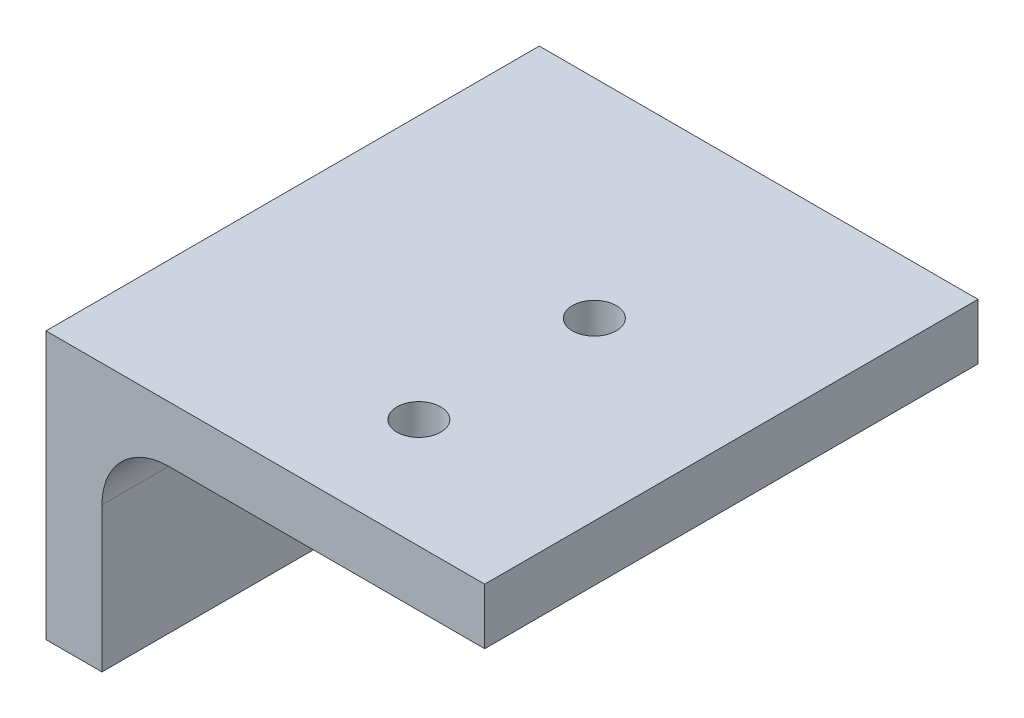
ISO-10303-21;
HEADER;
FILE_DESCRIPTION(('STEP AP214'),'2;1');
FILE_NAME('part.step','',(''),(''),'','','');
FILE_SCHEMA(('AUTOMOTIVE_DESIGN { 1 0 10303 214 1 1 1 1 }'));
ENDSEC;
DATA;
#1=APPLICATION_CONTEXT('core data for automotive mechanical design processes');
#2=APPLICATION_PROTOCOL_DEFINITION('international standard','automotive_design',2000,#1);
#3=PRODUCT_CONTEXT('',#1,'mechanical');
#4=PRODUCT('Part','Part','',(#3));
#5=PRODUCT_RELATED_PRODUCT_CATEGORY('part','',(#4));
#6=PRODUCT_DEFINITION_FORMATION('','',#4);
#7=PRODUCT_DEFINITION_CONTEXT('part definition',#1,'design');
#8=PRODUCT_DEFINITION('design','',#6,#7);
#9=PRODUCT_DEFINITION_SHAPE('','',#8);
#10=(LENGTH_UNIT() NAMED_UNIT(*) SI_UNIT(.MILLI.,.METRE.));
#11=(NAMED_UNIT(*) PLANE_ANGLE_UNIT() SI_UNIT($,.RADIAN.));
#12=(NAMED_UNIT(*) SI_UNIT($,.STERADIAN.) SOLID_ANGLE_UNIT());
#13=UNCERTAINTY_MEASURE_WITH_UNIT(LENGTH_MEASURE(1.E-05),#10,'distance_accuracy_value','');
#14=(GEOMETRIC_REPRESENTATION_CONTEXT(3) GLOBAL_UNCERTAINTY_ASSIGNED_CONTEXT((#13)) GLOBAL_UNIT_ASSIGNED_CONTEXT((#10,
#11,#12)) REPRESENTATION_CONTEXT('',''));
#15=CARTESIAN_POINT('',(0.,0.,0.));
#16=DIRECTION('',(0.,0.,1.));
#17=DIRECTION('',(1.,0.,0.));
#18=AXIS2_PLACEMENT_3D('',#15,#16,#17);
#19=CARTESIAN_POINT('',(95.3299999999999,-9.4,-56.22));
#20=DIRECTION('',(0.,1.,0.));
#21=DIRECTION('',(-1.,0.,0.));
#22=AXIS2_PLACEMENT_3D('',#19,#20,#21);
#23=PLANE('',#22);
#24=CARTESIAN_POINT('',(75.3299999999999,-9.40000000000002,-12.4935884323905));
#25=DIRECTION('',(0.,1.,0.));
#26=DIRECTION('',(0.,0.,1.));
#27=AXIS2_PLACEMENT_3D('',#24,#25,#26);
#28=CIRCLE('',#27,2.49999999999999);
#29=CARTESIAN_POINT('',(75.3299999999999,-9.40000000000002,-9.99358843239047));
#30=VERTEX_POINT('',#29);
#31=EDGE_CURVE('E152',#30,#30,#28,.T.);
#32=ORIENTED_EDGE('',*,*,#31,.F.);
#33=EDGE_LOOP('',(#32));
#34=FACE_BOUND('',#33,.T.);
#35=CARTESIAN_POINT('',(75.3299999999999,-9.40000000000002,-32.4935884323905));
#36=DIRECTION('',(0.,1.,0.));
#37=DIRECTION('',(0.,0.,1.));
#38=AXIS2_PLACEMENT_3D('',#35,#36,#37);
#39=CIRCLE('',#38,2.50000000000001);
#40=CARTESIAN_POINT('',(75.3299999999999,-9.40000000000002,-29.9935884323905));
#41=VERTEX_POINT('',#40);
#42=EDGE_CURVE('E157',#41,#41,#39,.T.);
#43=ORIENTED_EDGE('',*,*,#42,.F.);
#44=EDGE_LOOP('',(#43));
#45=FACE_BOUND('',#44,.T.);
#46=DIRECTION('',(-1.,0.,0.));
#47=VECTOR('',#46,1.);
#48=CARTESIAN_POINT('',(95.3299999999999,-9.4,0.));
#49=LINE('',#48,#47);
#50=CARTESIAN_POINT('',(95.3299999999999,-9.4,0.));
#51=VERTEX_POINT('',#50);
#52=CARTESIAN_POINT('',(45.3299999999999,-9.40000000000001,0.));
#53=VERTEX_POINT('',#52);
#54=EDGE_CURVE('E125',#51,#53,#49,.T.);
#55=ORIENTED_EDGE('',*,*,#54,.F.);
#56=DIRECTION('',(0.,0.,1.));
#57=VECTOR('',#56,1.);
#58=CARTESIAN_POINT('',(95.3299999999999,-9.4,-56.22));
#59=LINE('',#58,#57);
#60=CARTESIAN_POINT('',(95.3299999999999,-9.4,-56.22));
#61=VERTEX_POINT('',#60);
#62=EDGE_CURVE('E11',#61,#51,#59,.T.);
#63=ORIENTED_EDGE('',*,*,#62,.F.);
#64=DIRECTION('',(-1.,0.,0.));
#65=VECTOR('',#64,1.);
#66=CARTESIAN_POINT('',(95.3299999999999,-9.4,-56.22));
#67=LINE('',#66,#65);
#68=CARTESIAN_POINT('',(45.3299999999999,-9.40000000000001,-56.22));
#69=VERTEX_POINT('',#68);
#70=EDGE_CURVE('E142',#61,#69,#67,.T.);
#71=ORIENTED_EDGE('',*,*,#70,.T.);
#72=DIRECTION('',(0.,0.,1.));
#73=VECTOR('',#72,1.);
#74=CARTESIAN_POINT('',(45.3299999999999,-9.40000000000001,-56.22));
#75=LINE('',#74,#73);
#76=EDGE_CURVE('E86',#69,#53,#75,.T.);
#77=ORIENTED_EDGE('',*,*,#76,.T.);
#78=EDGE_LOOP('',(#55,#63,#71,#77));
#79=FACE_BOUND('',#78,.T.);
#80=ADVANCED_FACE('F33',(#34,#45,#79),#23,.T.);
#81=CARTESIAN_POINT('',(95.3299999999999,-15.7754,-56.22));
#82=DIRECTION('',(1.,0.,0.));
#83=DIRECTION('',(0.,0.,-1.));
#84=AXIS2_PLACEMENT_3D('',#81,#82,#83);
#85=PLANE('',#84);
#86=DIRECTION('',(0.,1.,0.));
#87=VECTOR('',#86,1.);
#88=CARTESIAN_POINT('',(95.3299999999999,-15.7754,0.));
#89=LINE('',#88,#87);
#90=CARTESIAN_POINT('',(95.3299999999999,-15.7754,0.));
#91=VERTEX_POINT('',#90);
#92=EDGE_CURVE('E140',#91,#51,#89,.T.);
#93=ORIENTED_EDGE('',*,*,#92,.F.);
#94=DIRECTION('',(0.,0.,1.));
#95=VECTOR('',#94,1.);
#96=CARTESIAN_POINT('',(95.3299999999999,-15.7754,-56.22));
#97=LINE('',#96,#95);
#98=CARTESIAN_POINT('',(95.3299999999999,-15.7754,-56.22));
#99=VERTEX_POINT('',#98);
#100=EDGE_CURVE('E42',#99,#91,#97,.T.);
#101=ORIENTED_EDGE('',*,*,#100,.F.);
#102=DIRECTION('',(0.,1.,0.));
#103=VECTOR('',#102,1.);
#104=CARTESIAN_POINT('',(95.3299999999999,-15.7754,-56.22));
#105=LINE('',#104,#103);
#106=EDGE_CURVE('E115',#99,#61,#105,.T.);
#107=ORIENTED_EDGE('',*,*,#106,.T.);
#108=ORIENTED_EDGE('',*,*,#62,.T.);
#109=EDGE_LOOP('',(#93,#101,#107,#108));
#110=FACE_BOUND('',#109,.T.);
#111=ADVANCED_FACE('F178',(#110),#85,.T.);
#112=CARTESIAN_POINT('',(59.3253999999999,-15.7754,-56.22));
#113=DIRECTION('',(0.,-1.,0.));
#114=DIRECTION('',(0.,0.,-1.));
#115=AXIS2_PLACEMENT_3D('',#112,#113,#114);
#116=PLANE('',#115);
#117=CARTESIAN_POINT('',(75.3299999999999,-15.7754,-12.4935884323905));
#118=DIRECTION('',(0.,-1.,0.));
#119=DIRECTION('',(0.,0.,-1.));
#120=AXIS2_PLACEMENT_3D('',#117,#118,#119);
#121=CIRCLE('',#120,2.49999999999999);
#122=CARTESIAN_POINT('',(75.3299999999999,-15.7754,-14.9935884323905));
#123=VERTEX_POINT('',#122);
#124=EDGE_CURVE('E36',#123,#123,#121,.T.);
#125=ORIENTED_EDGE('',*,*,#124,.F.);
#126=EDGE_LOOP('',(#125));
#127=FACE_BOUND('',#126,.T.);
#128=CARTESIAN_POINT('',(75.3299999999999,-15.7754,-32.4935884323905));
#129=DIRECTION('',(0.,-1.,0.));
#130=DIRECTION('',(0.,0.,-1.));
#131=AXIS2_PLACEMENT_3D('',#128,#129,#130);
#132=CIRCLE('',#131,2.50000000000001);
#133=CARTESIAN_POINT('',(75.3299999999999,-15.7754,-34.9935884323905));
#134=VERTEX_POINT('',#133);
#135=EDGE_CURVE('E150',#134,#134,#132,.T.);
#136=ORIENTED_EDGE('',*,*,#135,.F.);
#137=EDGE_LOOP('',(#136));
#138=FACE_BOUND('',#137,.T.);
#139=DIRECTION('',(1.,0.,0.));
#140=VECTOR('',#139,1.);
#141=CARTESIAN_POINT('',(59.3253999999999,-15.7754,0.));
#142=LINE('',#141,#140);
#143=CARTESIAN_POINT('',(59.3253999999999,-15.7754,0.));
#144=VERTEX_POINT('',#143);
#145=EDGE_CURVE('E102',#144,#91,#142,.T.);
#146=ORIENTED_EDGE('',*,*,#145,.F.);
#147=DIRECTION('',(0.,0.,1.));
#148=VECTOR('',#147,1.);
#149=CARTESIAN_POINT('',(59.3253999999999,-15.7754,-56.22));
#150=LINE('',#149,#148);
#151=CARTESIAN_POINT('',(59.3253999999999,-15.7754,-56.22));
#152=VERTEX_POINT('',#151);
#153=EDGE_CURVE('E97',#152,#144,#150,.T.);
#154=ORIENTED_EDGE('',*,*,#153,.F.);
#155=DIRECTION('',(1.,0.,0.));
#156=VECTOR('',#155,1.);
#157=CARTESIAN_POINT('',(59.3253999999999,-15.7754,-56.22));
#158=LINE('',#157,#156);
#159=EDGE_CURVE('E100',#152,#99,#158,.T.);
#160=ORIENTED_EDGE('',*,*,#159,.T.);
#161=ORIENTED_EDGE('',*,*,#100,.T.);
#162=EDGE_LOOP('',(#146,#154,#160,#161));
#163=FACE_BOUND('',#162,.T.);
#164=ADVANCED_FACE('F99',(#127,#138,#163),#116,.T.);
#165=CARTESIAN_POINT('',(59.3253999999999,-23.3954,-56.22));
#166=DIRECTION('',(0.,0.,1.));
#167=DIRECTION('',(1.,0.,0.));
#168=AXIS2_PLACEMENT_3D('',#165,#166,#167);
#169=CYLINDRICAL_SURFACE('',#168,7.62);
#170=CARTESIAN_POINT('',(59.3253999999999,-23.3954,0.));
#171=DIRECTION('',(0.,0.,-1.));
#172=DIRECTION('',(1.,0.,0.));
#173=AXIS2_PLACEMENT_3D('',#170,#171,#172);
#174=CIRCLE('',#173,7.62);
#175=CARTESIAN_POINT('',(51.7053999999999,-23.3954,0.));
#176=VERTEX_POINT('',#175);
#177=EDGE_CURVE('E137',#176,#144,#174,.T.);
#178=ORIENTED_EDGE('',*,*,#177,.F.);
#179=DIRECTION('',(0.,0.,1.));
#180=VECTOR('',#179,1.);
#181=CARTESIAN_POINT('',(51.7053999999999,-23.3954,-56.22));
#182=LINE('',#181,#180);
#183=CARTESIAN_POINT('',(51.7053999999999,-23.3954,-56.22));
#184=VERTEX_POINT('',#183);
#185=EDGE_CURVE('E107',#184,#176,#182,.T.);
#186=ORIENTED_EDGE('',*,*,#185,.F.);
#187=CARTESIAN_POINT('',(59.3253999999999,-23.3954,-56.22));
#188=DIRECTION('',(0.,0.,-1.));
#189=DIRECTION('',(1.,0.,0.));
#190=AXIS2_PLACEMENT_3D('',#187,#188,#189);
#191=CIRCLE('',#190,7.62);
#192=EDGE_CURVE('E113',#184,#152,#191,.T.);
#193=ORIENTED_EDGE('',*,*,#192,.T.);
#194=ORIENTED_EDGE('',*,*,#153,.T.);
#195=EDGE_LOOP('',(#178,#186,#193,#194));
#196=FACE_BOUND('',#195,.T.);
#197=ADVANCED_FACE('F117',(#196),#169,.F.);
#198=CARTESIAN_POINT('',(51.7053999999999,-39.88,-56.22));
#199=DIRECTION('',(1.,0.,0.));
#200=DIRECTION('',(0.,0.,-1.));
#201=AXIS2_PLACEMENT_3D('',#198,#199,#200);
#202=PLANE('',#201);
#203=CARTESIAN_POINT('',(51.7053999999999,-27.18,-32.598));
#204=DIRECTION('',(1.,0.,0.));
#205=DIRECTION('',(0.,0.,-1.));
#206=AXIS2_PLACEMENT_3D('',#203,#204,#205);
#207=CIRCLE('',#206,2.5);
#208=CARTESIAN_POINT('',(51.7053999999999,-27.18,-35.098));
#209=VERTEX_POINT('',#208);
#210=EDGE_CURVE('E162',#209,#209,#207,.T.);
#211=ORIENTED_EDGE('',*,*,#210,.F.);
#212=EDGE_LOOP('',(#211));
#213=FACE_BOUND('',#212,.T.);
#214=DIRECTION('',(0.,1.,0.));
#215=VECTOR('',#214,1.);
#216=CARTESIAN_POINT('',(51.7053999999999,-39.88,0.));
#217=LINE('',#216,#215);
#218=CARTESIAN_POINT('',(51.7053999999999,-39.88,0.));
#219=VERTEX_POINT('',#218);
#220=EDGE_CURVE('E134',#219,#176,#217,.T.);
#221=ORIENTED_EDGE('',*,*,#220,.F.);
#222=DIRECTION('',(0.,0.,1.));
#223=VECTOR('',#222,1.);
#224=CARTESIAN_POINT('',(51.7053999999999,-39.88,-56.22));
#225=LINE('',#224,#223);
#226=CARTESIAN_POINT('',(51.7053999999999,-39.88,-56.22));
#227=VERTEX_POINT('',#226);
#228=EDGE_CURVE('E146',#227,#219,#225,.T.);
#229=ORIENTED_EDGE('',*,*,#228,.F.);
#230=DIRECTION('',(0.,1.,0.));
#231=VECTOR('',#230,1.);
#232=CARTESIAN_POINT('',(51.7053999999999,-39.88,-56.22));
#233=LINE('',#232,#231);
#234=EDGE_CURVE('E118',#227,#184,#233,.T.);
#235=ORIENTED_EDGE('',*,*,#234,.T.);
#236=ORIENTED_EDGE('',*,*,#185,.T.);
#237=EDGE_LOOP('',(#221,#229,#235,#236));
#238=FACE_BOUND('',#237,.T.);
#239=ADVANCED_FACE('F193',(#213,#238),#202,.T.);
#240=CARTESIAN_POINT('',(45.3299999999999,-39.88,-56.22));
#241=DIRECTION('',(0.,-1.,0.));
#242=DIRECTION('',(0.,0.,-1.));
#243=AXIS2_PLACEMENT_3D('',#240,#241,#242);
#244=PLANE('',#243);
#245=DIRECTION('',(1.,0.,0.));
#246=VECTOR('',#245,1.);
#247=CARTESIAN_POINT('',(45.3299999999999,-39.88,0.));
#248=LINE('',#247,#246);
#249=CARTESIAN_POINT('',(45.3299999999999,-39.88,0.));
#250=VERTEX_POINT('',#249);
#251=EDGE_CURVE('E131',#250,#219,#248,.T.);
#252=ORIENTED_EDGE('',*,*,#251,.F.);
#253=DIRECTION('',(0.,0.,1.));
#254=VECTOR('',#253,1.);
#255=CARTESIAN_POINT('',(45.3299999999999,-39.88,-56.22));
#256=LINE('',#255,#254);
#257=CARTESIAN_POINT('',(45.3299999999999,-39.88,-56.22));
#258=VERTEX_POINT('',#257);
#259=EDGE_CURVE('E148',#258,#250,#256,.T.);
#260=ORIENTED_EDGE('',*,*,#259,.F.);
#261=DIRECTION('',(1.,0.,0.));
#262=VECTOR('',#261,1.);
#263=CARTESIAN_POINT('',(45.3299999999999,-39.88,-56.22));
#264=LINE('',#263,#262);
#265=EDGE_CURVE('E120',#258,#227,#264,.T.);
#266=ORIENTED_EDGE('',*,*,#265,.T.);
#267=ORIENTED_EDGE('',*,*,#228,.T.);
#268=EDGE_LOOP('',(#252,#260,#266,#267));
#269=FACE_BOUND('',#268,.T.);
#270=ADVANCED_FACE('F173',(#269),#244,.T.);
#271=CARTESIAN_POINT('',(45.3299999999999,-9.40000000000001,-56.22));
#272=DIRECTION('',(-1.,0.,0.));
#273=DIRECTION('',(0.,0.,1.));
#274=AXIS2_PLACEMENT_3D('',#271,#272,#273);
#275=PLANE('',#274);
#276=CARTESIAN_POINT('',(45.3299999999999,-27.18,-32.598));
#277=DIRECTION('',(-1.,0.,0.));
#278=DIRECTION('',(0.,-1.,0.));
#279=AXIS2_PLACEMENT_3D('',#276,#277,#278);
#280=CIRCLE('',#279,2.5);
#281=CARTESIAN_POINT('',(45.3299999999999,-29.68,-32.598));
#282=VERTEX_POINT('',#281);
#283=EDGE_CURVE('E205',#282,#282,#280,.T.);
#284=ORIENTED_EDGE('',*,*,#283,.F.);
#285=EDGE_LOOP('',(#284));
#286=FACE_BOUND('',#285,.T.);
#287=DIRECTION('',(0.,-1.,0.));
#288=VECTOR('',#287,1.);
#289=CARTESIAN_POINT('',(45.3299999999999,-9.40000000000001,0.));
#290=LINE('',#289,#288);
#291=EDGE_CURVE('E128',#53,#250,#290,.T.);
#292=ORIENTED_EDGE('',*,*,#291,.F.);
#293=ORIENTED_EDGE('',*,*,#76,.F.);
#294=DIRECTION('',(0.,-1.,0.));
#295=VECTOR('',#294,1.);
#296=CARTESIAN_POINT('',(45.3299999999999,-9.40000000000001,-56.22));
#297=LINE('',#296,#295);
#298=EDGE_CURVE('E168',#69,#258,#297,.T.);
#299=ORIENTED_EDGE('',*,*,#298,.T.);
#300=ORIENTED_EDGE('',*,*,#259,.T.);
#301=EDGE_LOOP('',(#292,#293,#299,#300));
#302=FACE_BOUND('',#301,.T.);
#303=ADVANCED_FACE('F175',(#286,#302),#275,.T.);
#304=CARTESIAN_POINT('',(59.3253999999999,-23.3954,-56.22));
#305=DIRECTION('',(0.,0.,1.));
#306=DIRECTION('',(1.,0.,0.));
#307=AXIS2_PLACEMENT_3D('',#304,#305,#306);
#308=PLANE('',#307);
#309=ORIENTED_EDGE('',*,*,#70,.F.);
#310=ORIENTED_EDGE('',*,*,#106,.F.);
#311=ORIENTED_EDGE('',*,*,#159,.F.);
#312=ORIENTED_EDGE('',*,*,#192,.F.);
#313=ORIENTED_EDGE('',*,*,#234,.F.);
#314=ORIENTED_EDGE('',*,*,#265,.F.);
#315=ORIENTED_EDGE('',*,*,#298,.F.);
#316=EDGE_LOOP('',(#309,#310,#311,#312,#313,#314,#315));
#317=FACE_BOUND('',#316,.T.);
#318=ADVANCED_FACE('F111',(#317),#308,.F.);
#319=CARTESIAN_POINT('',(59.3253999999999,-23.3954,0.));
#320=DIRECTION('',(0.,0.,1.));
#321=DIRECTION('',(1.,0.,0.));
#322=AXIS2_PLACEMENT_3D('',#319,#320,#321);
#323=PLANE('',#322);
#324=ORIENTED_EDGE('',*,*,#54,.T.);
#325=ORIENTED_EDGE('',*,*,#291,.T.);
#326=ORIENTED_EDGE('',*,*,#251,.T.);
#327=ORIENTED_EDGE('',*,*,#220,.T.);
#328=ORIENTED_EDGE('',*,*,#177,.T.);
#329=ORIENTED_EDGE('',*,*,#145,.T.);
#330=ORIENTED_EDGE('',*,*,#92,.T.);
#331=EDGE_LOOP('',(#324,#325,#326,#327,#328,#329,#330));
#332=FACE_BOUND('',#331,.T.);
#333=ADVANCED_FACE('F177',(#332),#323,.T.);
#334=CARTESIAN_POINT('',(75.3299999999999,-39.88,-32.4935884323905));
#335=DIRECTION('',(0.,1.,0.));
#336=DIRECTION('',(0.,0.,1.));
#337=AXIS2_PLACEMENT_3D('',#334,#335,#336);
#338=CYLINDRICAL_SURFACE('',#337,2.50000000000001);
#339=ORIENTED_EDGE('',*,*,#135,.T.);
#340=EDGE_LOOP('',(#339));
#341=FACE_BOUND('',#340,.T.);
#342=ORIENTED_EDGE('',*,*,#42,.T.);
#343=EDGE_LOOP('',(#342));
#344=FACE_BOUND('',#343,.T.);
#345=ADVANCED_FACE('F218',(#341,#344),#338,.F.);
#346=CARTESIAN_POINT('',(75.3299999999999,-39.88,-12.4935884323905));
#347=DIRECTION('',(0.,1.,0.));
#348=DIRECTION('',(0.,0.,1.));
#349=AXIS2_PLACEMENT_3D('',#346,#347,#348);
#350=CYLINDRICAL_SURFACE('',#349,2.49999999999999);
#351=ORIENTED_EDGE('',*,*,#124,.T.);
#352=EDGE_LOOP('',(#351));
#353=FACE_BOUND('',#352,.T.);
#354=ORIENTED_EDGE('',*,*,#31,.T.);
#355=EDGE_LOOP('',(#354));
#356=FACE_BOUND('',#355,.T.);
#357=ADVANCED_FACE('F213',(#353,#356),#350,.F.);
#358=CARTESIAN_POINT('',(95.3299999999999,-27.18,-32.598));
#359=DIRECTION('',(-1.,0.,0.));
#360=DIRECTION('',(0.,-1.,0.));
#361=AXIS2_PLACEMENT_3D('',#358,#359,#360);
#362=CYLINDRICAL_SURFACE('',#361,2.5);
#363=ORIENTED_EDGE('',*,*,#210,.T.);
#364=EDGE_LOOP('',(#363));
#365=FACE_BOUND('',#364,.T.);
#366=ORIENTED_EDGE('',*,*,#283,.T.);
#367=EDGE_LOOP('',(#366));
#368=FACE_BOUND('',#367,.T.);
#369=ADVANCED_FACE('F210',(#365,#368),#362,.F.);
#370=CLOSED_SHELL('',(#80,#111,#164,#197,#239,#270,#303,#318,#333,#345,#357,#369));
#371=MANIFOLD_SOLID_BREP('B2',#370);
#372=ADVANCED_BREP_SHAPE_REPRESENTATION('',(#18,#371),#14);
#373=SHAPE_DEFINITION_REPRESENTATION(#9,#372);
ENDSEC;
END-ISO-10303-21;
